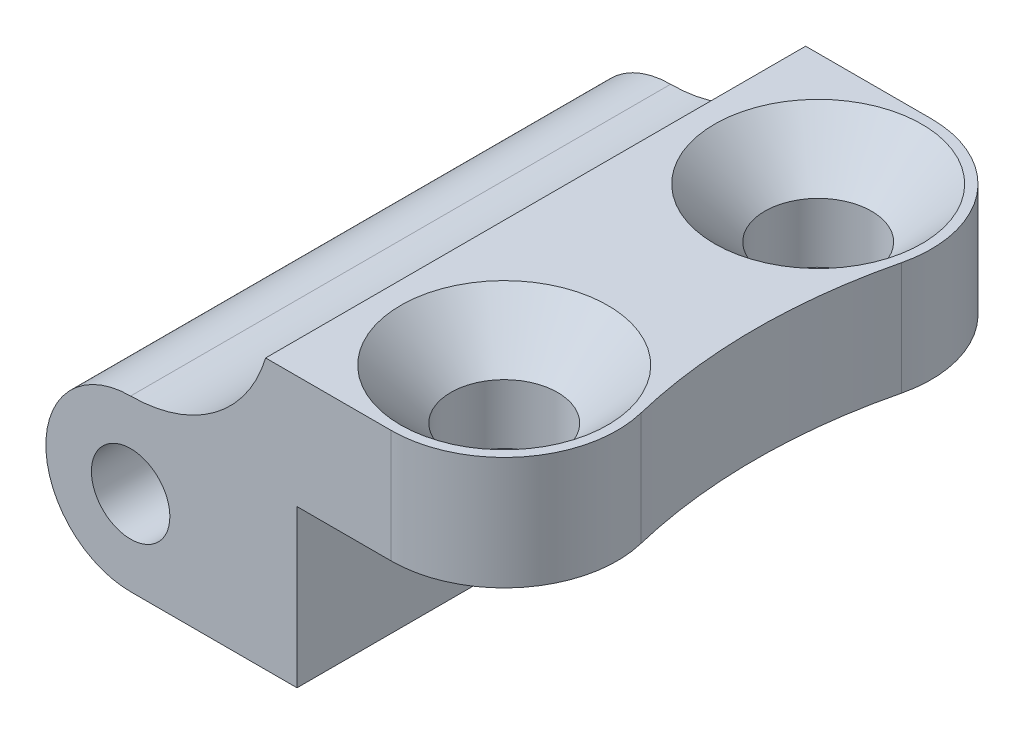
ISO-10303-21;
HEADER;
FILE_DESCRIPTION(('STEP AP214'),'2;1');
FILE_NAME('part.step','',(''),(''),'','','');
FILE_SCHEMA(('AUTOMOTIVE_DESIGN { 1 0 10303 214 1 1 1 1 }'));
ENDSEC;
DATA;
#1=APPLICATION_CONTEXT('core data for automotive mechanical design processes');
#2=APPLICATION_PROTOCOL_DEFINITION('international standard','automotive_design',2000,#1);
#3=PRODUCT_CONTEXT('',#1,'mechanical');
#4=PRODUCT('Part','Part','',(#3));
#5=PRODUCT_RELATED_PRODUCT_CATEGORY('part','',(#4));
#6=PRODUCT_DEFINITION_FORMATION('','',#4);
#7=PRODUCT_DEFINITION_CONTEXT('part definition',#1,'design');
#8=PRODUCT_DEFINITION('design','',#6,#7);
#9=PRODUCT_DEFINITION_SHAPE('','',#8);
#10=(LENGTH_UNIT() NAMED_UNIT(*) SI_UNIT(.MILLI.,.METRE.));
#11=(NAMED_UNIT(*) PLANE_ANGLE_UNIT() SI_UNIT($,.RADIAN.));
#12=(NAMED_UNIT(*) SI_UNIT($,.STERADIAN.) SOLID_ANGLE_UNIT());
#13=UNCERTAINTY_MEASURE_WITH_UNIT(LENGTH_MEASURE(1.E-05),#10,'distance_accuracy_value','');
#14=(GEOMETRIC_REPRESENTATION_CONTEXT(3) GLOBAL_UNCERTAINTY_ASSIGNED_CONTEXT((#13)) GLOBAL_UNIT_ASSIGNED_CONTEXT((#10,
#11,#12)) REPRESENTATION_CONTEXT('',''));
#15=CARTESIAN_POINT('',(0.,0.,0.));
#16=DIRECTION('',(0.,0.,1.));
#17=DIRECTION('',(1.,0.,0.));
#18=AXIS2_PLACEMENT_3D('',#15,#16,#17);
#19=CARTESIAN_POINT('',(0.,0.,0.));
#20=DIRECTION('',(0.,0.,1.));
#21=DIRECTION('',(1.,0.,0.));
#22=AXIS2_PLACEMENT_3D('',#19,#20,#21);
#23=PLANE('',#22);
#24=CARTESIAN_POINT('',(0.,0.,0.));
#25=DIRECTION('',(0.,0.,1.));
#26=DIRECTION('',(1.,0.,0.));
#27=AXIS2_PLACEMENT_3D('',#24,#25,#26);
#28=CIRCLE('',#27,1.25);
#29=CARTESIAN_POINT('',(1.25,0.,0.));
#30=VERTEX_POINT('',#29);
#31=EDGE_CURVE('E199',#30,#30,#28,.T.);
#32=ORIENTED_EDGE('',*,*,#31,.T.);
#33=EDGE_LOOP('',(#32));
#34=FACE_BOUND('',#33,.T.);
#35=DIRECTION('',(0.,1.,0.));
#36=VECTOR('',#35,1.);
#37=CARTESIAN_POINT('',(8.3,-2.7,0.));
#38=LINE('',#37,#36);
#39=CARTESIAN_POINT('',(8.3,2.3,0.));
#40=VERTEX_POINT('',#39);
#41=CARTESIAN_POINT('',(8.29999999999999,5.9,0.));
#42=VERTEX_POINT('',#41);
#43=EDGE_CURVE('E185',#40,#42,#38,.T.);
#44=ORIENTED_EDGE('',*,*,#43,.F.);
#45=DIRECTION('',(1.,0.,0.));
#46=VECTOR('',#45,1.);
#47=CARTESIAN_POINT('',(5.3,2.3,0.));
#48=LINE('',#47,#46);
#49=CARTESIAN_POINT('',(5.3,2.3,0.));
#50=VERTEX_POINT('',#49);
#51=EDGE_CURVE('E227',#50,#40,#48,.T.);
#52=ORIENTED_EDGE('',*,*,#51,.F.);
#53=DIRECTION('',(0.,1.,0.));
#54=VECTOR('',#53,1.);
#55=CARTESIAN_POINT('',(5.3,-2.7,0.));
#56=LINE('',#55,#54);
#57=CARTESIAN_POINT('',(5.3,-2.7,0.));
#58=VERTEX_POINT('',#57);
#59=EDGE_CURVE('E132',#58,#50,#56,.T.);
#60=ORIENTED_EDGE('',*,*,#59,.F.);
#61=DIRECTION('',(1.,0.,0.));
#62=VECTOR('',#61,1.);
#63=CARTESIAN_POINT('',(0.,-2.7,0.));
#64=LINE('',#63,#62);
#65=CARTESIAN_POINT('',(0.,-2.7,0.));
#66=VERTEX_POINT('',#65);
#67=EDGE_CURVE('E224',#66,#58,#64,.T.);
#68=ORIENTED_EDGE('',*,*,#67,.F.);
#69=CARTESIAN_POINT('',(0.,0.,0.));
#70=DIRECTION('',(0.,0.,1.));
#71=DIRECTION('',(1.,0.,0.));
#72=AXIS2_PLACEMENT_3D('',#69,#70,#71);
#73=CIRCLE('',#72,2.7);
#74=CARTESIAN_POINT('',(0.,2.7,0.));
#75=VERTEX_POINT('',#74);
#76=EDGE_CURVE('E203',#75,#66,#73,.T.);
#77=ORIENTED_EDGE('',*,*,#76,.F.);
#78=CARTESIAN_POINT('',(0.,7.1890625,0.));
#79=DIRECTION('',(0.,0.,-1.));
#80=DIRECTION('',(1.,0.,0.));
#81=AXIS2_PLACEMENT_3D('',#78,#79,#80);
#82=CIRCLE('',#81,4.48906249999999);
#83=CARTESIAN_POINT('',(4.3,5.9,0.));
#84=VERTEX_POINT('',#83);
#85=EDGE_CURVE('E210',#84,#75,#82,.T.);
#86=ORIENTED_EDGE('',*,*,#85,.F.);
#87=DIRECTION('',(-1.,0.,0.));
#88=VECTOR('',#87,1.);
#89=CARTESIAN_POINT('',(12.8,5.9,0.));
#90=LINE('',#89,#88);
#91=EDGE_CURVE('E229',#42,#84,#90,.T.);
#92=ORIENTED_EDGE('',*,*,#91,.F.);
#93=EDGE_LOOP('',(#44,#52,#60,#68,#77,#86,#92));
#94=FACE_BOUND('',#93,.T.);
#95=ADVANCED_FACE('F34',(#34,#94),#23,.F.);
#96=CARTESIAN_POINT('',(5.3,2.3,17.2));
#97=DIRECTION('',(0.,1.,0.));
#98=DIRECTION('',(0.,0.,1.));
#99=AXIS2_PLACEMENT_3D('',#96,#97,#98);
#100=PLANE('',#99);
#101=CARTESIAN_POINT('',(8.29999999999999,2.3,3.6));
#102=DIRECTION('',(0.,1.,0.));
#103=DIRECTION('',(0.,0.,1.));
#104=AXIS2_PLACEMENT_3D('',#101,#102,#103);
#105=CIRCLE('',#104,1.53357205176495);
#106=CARTESIAN_POINT('',(8.29999999999999,2.3,5.13357205176495));
#107=VERTEX_POINT('',#106);
#108=EDGE_CURVE('E38',#107,#107,#105,.T.);
#109=ORIENTED_EDGE('',*,*,#108,.T.);
#110=EDGE_LOOP('',(#109));
#111=FACE_BOUND('',#110,.T.);
#112=CARTESIAN_POINT('',(8.3,2.3,13.6));
#113=DIRECTION('',(0.,1.,0.));
#114=DIRECTION('',(0.,0.,1.));
#115=AXIS2_PLACEMENT_3D('',#112,#113,#114);
#116=CIRCLE('',#115,1.53357205176495);
#117=CARTESIAN_POINT('',(8.3,2.3,15.133572051765));
#118=VERTEX_POINT('',#117);
#119=EDGE_CURVE('E173',#118,#118,#116,.T.);
#120=ORIENTED_EDGE('',*,*,#119,.T.);
#121=EDGE_LOOP('',(#120));
#122=FACE_BOUND('',#121,.T.);
#123=DIRECTION('',(0.,0.,-1.));
#124=VECTOR('',#123,1.);
#125=CARTESIAN_POINT('',(5.3,2.3,17.2));
#126=LINE('',#125,#124);
#127=CARTESIAN_POINT('',(5.3,2.3,17.2));
#128=VERTEX_POINT('',#127);
#129=CARTESIAN_POINT('',(5.3,2.3,11.4));
#130=VERTEX_POINT('',#129);
#131=EDGE_CURVE('E135',#128,#130,#126,.T.);
#132=ORIENTED_EDGE('',*,*,#131,.T.);
#133=DIRECTION('',(-1.,0.,0.));
#134=VECTOR('',#133,1.);
#135=CARTESIAN_POINT('',(8.12842712474619,2.3,11.4));
#136=LINE('',#135,#134);
#137=CARTESIAN_POINT('',(8.12842712474619,2.3,11.4));
#138=VERTEX_POINT('',#137);
#139=EDGE_CURVE('E51',#138,#130,#136,.T.);
#140=ORIENTED_EDGE('',*,*,#139,.F.);
#141=DIRECTION('',(0.,0.,-1.));
#142=VECTOR('',#141,1.);
#143=CARTESIAN_POINT('',(8.12842712474619,2.3,11.4));
#144=LINE('',#143,#142);
#145=CARTESIAN_POINT('',(8.12842712474619,2.3,7.4));
#146=VERTEX_POINT('',#145);
#147=EDGE_CURVE('E56',#138,#146,#144,.T.);
#148=ORIENTED_EDGE('',*,*,#147,.T.);
#149=DIRECTION('',(-1.,0.,0.));
#150=VECTOR('',#149,1.);
#151=CARTESIAN_POINT('',(8.12842712474619,2.3,7.4));
#152=LINE('',#151,#150);
#153=CARTESIAN_POINT('',(5.3,2.3,7.4));
#154=VERTEX_POINT('',#153);
#155=EDGE_CURVE('E138',#146,#154,#152,.T.);
#156=ORIENTED_EDGE('',*,*,#155,.T.);
#157=EDGE_CURVE('E125',#154,#50,#126,.T.);
#158=ORIENTED_EDGE('',*,*,#157,.T.);
#159=ORIENTED_EDGE('',*,*,#51,.T.);
#160=CARTESIAN_POINT('',(8.3,2.3,3.6));
#161=DIRECTION('',(0.,1.,0.));
#162=DIRECTION('',(0.,0.,1.));
#163=AXIS2_PLACEMENT_3D('',#160,#161,#162);
#164=CIRCLE('',#163,3.6);
#165=CARTESIAN_POINT('',(11.7977917981073,2.3,4.45173501577287));
#166=VERTEX_POINT('',#165);
#167=EDGE_CURVE('E194',#166,#40,#164,.T.);
#168=ORIENTED_EDGE('',*,*,#167,.F.);
#169=CARTESIAN_POINT('',(28.8333333333334,2.3,8.6));
#170=DIRECTION('',(0.,1.,0.));
#171=DIRECTION('',(0.,0.,1.));
#172=AXIS2_PLACEMENT_3D('',#169,#170,#171);
#173=CIRCLE('',#172,17.5333333333334);
#174=CARTESIAN_POINT('',(11.7977917981073,2.3,12.7482649842271));
#175=VERTEX_POINT('',#174);
#176=EDGE_CURVE('E196',#166,#175,#173,.T.);
#177=ORIENTED_EDGE('',*,*,#176,.T.);
#178=CARTESIAN_POINT('',(8.3,2.3,13.6));
#179=DIRECTION('',(0.,1.,0.));
#180=DIRECTION('',(0.,0.,1.));
#181=AXIS2_PLACEMENT_3D('',#178,#179,#180);
#182=CIRCLE('',#181,3.6);
#183=CARTESIAN_POINT('',(8.3,2.3,17.2));
#184=VERTEX_POINT('',#183);
#185=EDGE_CURVE('E184',#175,#184,#182,.F.);
#186=ORIENTED_EDGE('',*,*,#185,.T.);
#187=DIRECTION('',(1.,0.,0.));
#188=VECTOR('',#187,1.);
#189=CARTESIAN_POINT('',(5.3,2.3,17.2));
#190=LINE('',#189,#188);
#191=EDGE_CURVE('E214',#128,#184,#190,.T.);
#192=ORIENTED_EDGE('',*,*,#191,.F.);
#193=EDGE_LOOP('',(#132,#140,#148,#156,#158,#159,#168,#177,#186,#192));
#194=FACE_BOUND('',#193,.T.);
#195=ADVANCED_FACE('F139',(#111,#122,#194),#100,.F.);
#196=CARTESIAN_POINT('',(12.8,5.9,17.2));
#197=DIRECTION('',(0.,-1.,0.));
#198=DIRECTION('',(1.,0.,0.));
#199=AXIS2_PLACEMENT_3D('',#196,#197,#198);
#200=PLANE('',#199);
#201=CARTESIAN_POINT('',(8.29999999999999,5.9,3.6));
#202=DIRECTION('',(0.,1.,0.));
#203=DIRECTION('',(0.,0.,1.));
#204=AXIS2_PLACEMENT_3D('',#201,#202,#203);
#205=CIRCLE('',#204,3.3);
#206=CARTESIAN_POINT('',(8.29999999999999,5.9,6.9));
#207=VERTEX_POINT('',#206);
#208=EDGE_CURVE('E155',#207,#207,#205,.T.);
#209=ORIENTED_EDGE('',*,*,#208,.F.);
#210=EDGE_LOOP('',(#209));
#211=FACE_BOUND('',#210,.T.);
#212=CARTESIAN_POINT('',(8.3,5.9,13.6));
#213=DIRECTION('',(0.,1.,0.));
#214=DIRECTION('',(0.,0.,1.));
#215=AXIS2_PLACEMENT_3D('',#212,#213,#214);
#216=CIRCLE('',#215,3.3);
#217=CARTESIAN_POINT('',(8.3,5.9,16.9));
#218=VERTEX_POINT('',#217);
#219=EDGE_CURVE('E164',#218,#218,#216,.T.);
#220=ORIENTED_EDGE('',*,*,#219,.F.);
#221=EDGE_LOOP('',(#220));
#222=FACE_BOUND('',#221,.T.);
#223=CARTESIAN_POINT('',(8.29999999999999,5.9,3.6));
#224=DIRECTION('',(0.,1.,0.));
#225=DIRECTION('',(-1.,0.,0.));
#226=AXIS2_PLACEMENT_3D('',#223,#224,#225);
#227=CIRCLE('',#226,3.6);
#228=CARTESIAN_POINT('',(11.7977917981073,5.9,4.45173501577287));
#229=VERTEX_POINT('',#228);
#230=EDGE_CURVE('E178',#229,#42,#227,.T.);
#231=ORIENTED_EDGE('',*,*,#230,.T.);
#232=ORIENTED_EDGE('',*,*,#91,.T.);
#233=DIRECTION('',(0.,0.,-1.));
#234=VECTOR('',#233,1.);
#235=CARTESIAN_POINT('',(4.3,5.9,17.2));
#236=LINE('',#235,#234);
#237=CARTESIAN_POINT('',(4.3,5.9,17.2));
#238=VERTEX_POINT('',#237);
#239=EDGE_CURVE('E136',#238,#84,#236,.T.);
#240=ORIENTED_EDGE('',*,*,#239,.F.);
#241=DIRECTION('',(-1.,0.,0.));
#242=VECTOR('',#241,1.);
#243=CARTESIAN_POINT('',(12.8,5.9,17.2));
#244=LINE('',#243,#242);
#245=CARTESIAN_POINT('',(8.3,5.9,17.2));
#246=VERTEX_POINT('',#245);
#247=EDGE_CURVE('E217',#246,#238,#244,.T.);
#248=ORIENTED_EDGE('',*,*,#247,.F.);
#249=CARTESIAN_POINT('',(8.3,5.9,13.6));
#250=DIRECTION('',(0.,1.,0.));
#251=DIRECTION('',(-1.,0.,0.));
#252=AXIS2_PLACEMENT_3D('',#249,#250,#251);
#253=CIRCLE('',#252,3.6);
#254=CARTESIAN_POINT('',(11.7977917981073,5.9,12.7482649842271));
#255=VERTEX_POINT('',#254);
#256=EDGE_CURVE('E176',#255,#246,#253,.F.);
#257=ORIENTED_EDGE('',*,*,#256,.F.);
#258=CARTESIAN_POINT('',(28.8333333333334,5.9,8.6));
#259=DIRECTION('',(0.,1.,0.));
#260=DIRECTION('',(-1.,0.,0.));
#261=AXIS2_PLACEMENT_3D('',#258,#259,#260);
#262=CIRCLE('',#261,17.5333333333334);
#263=EDGE_CURVE('E174',#229,#255,#262,.T.);
#264=ORIENTED_EDGE('',*,*,#263,.F.);
#265=EDGE_LOOP('',(#231,#232,#240,#248,#257,#264));
#266=FACE_BOUND('',#265,.T.);
#267=ADVANCED_FACE('F263',(#211,#222,#266),#200,.F.);
#268=CARTESIAN_POINT('',(0.,0.,17.2));
#269=DIRECTION('',(0.,0.,1.));
#270=DIRECTION('',(1.,0.,0.));
#271=AXIS2_PLACEMENT_3D('',#268,#269,#270);
#272=PLANE('',#271);
#273=DIRECTION('',(0.,1.,0.));
#274=VECTOR('',#273,1.);
#275=CARTESIAN_POINT('',(8.3,-2.7,17.2));
#276=LINE('',#275,#274);
#277=EDGE_CURVE('E187',#184,#246,#276,.T.);
#278=ORIENTED_EDGE('',*,*,#277,.T.);
#279=ORIENTED_EDGE('',*,*,#247,.T.);
#280=CARTESIAN_POINT('',(0.,7.1890625,17.2));
#281=DIRECTION('',(0.,0.,-1.));
#282=DIRECTION('',(1.,0.,0.));
#283=AXIS2_PLACEMENT_3D('',#280,#281,#282);
#284=CIRCLE('',#283,4.48906249999999);
#285=CARTESIAN_POINT('',(0.,2.7,17.2));
#286=VERTEX_POINT('',#285);
#287=EDGE_CURVE('E219',#238,#286,#284,.T.);
#288=ORIENTED_EDGE('',*,*,#287,.T.);
#289=CARTESIAN_POINT('',(0.,0.,17.2));
#290=DIRECTION('',(0.,0.,1.));
#291=DIRECTION('',(1.,0.,0.));
#292=AXIS2_PLACEMENT_3D('',#289,#290,#291);
#293=CIRCLE('',#292,2.7);
#294=CARTESIAN_POINT('',(0.,-2.7,17.2));
#295=VERTEX_POINT('',#294);
#296=EDGE_CURVE('E206',#286,#295,#293,.T.);
#297=ORIENTED_EDGE('',*,*,#296,.T.);
#298=DIRECTION('',(1.,0.,0.));
#299=VECTOR('',#298,1.);
#300=CARTESIAN_POINT('',(0.,-2.7,17.2));
#301=LINE('',#300,#299);
#302=CARTESIAN_POINT('',(5.3,-2.7,17.2));
#303=VERTEX_POINT('',#302);
#304=EDGE_CURVE('E209',#295,#303,#301,.T.);
#305=ORIENTED_EDGE('',*,*,#304,.T.);
#306=DIRECTION('',(0.,1.,0.));
#307=VECTOR('',#306,1.);
#308=CARTESIAN_POINT('',(5.3,-2.7,17.2));
#309=LINE('',#308,#307);
#310=EDGE_CURVE('E212',#303,#128,#309,.T.);
#311=ORIENTED_EDGE('',*,*,#310,.T.);
#312=ORIENTED_EDGE('',*,*,#191,.T.);
#313=EDGE_LOOP('',(#278,#279,#288,#297,#305,#311,#312));
#314=FACE_BOUND('',#313,.T.);
#315=CARTESIAN_POINT('',(0.,0.,17.2));
#316=DIRECTION('',(0.,0.,1.));
#317=DIRECTION('',(1.,0.,0.));
#318=AXIS2_PLACEMENT_3D('',#315,#316,#317);
#319=CIRCLE('',#318,1.25);
#320=CARTESIAN_POINT('',(1.25,0.,17.2));
#321=VERTEX_POINT('',#320);
#322=EDGE_CURVE('E200',#321,#321,#319,.T.);
#323=ORIENTED_EDGE('',*,*,#322,.F.);
#324=EDGE_LOOP('',(#323));
#325=FACE_BOUND('',#324,.T.);
#326=ADVANCED_FACE('F269',(#314,#325),#272,.T.);
#327=CARTESIAN_POINT('',(0.,0.,17.2));
#328=DIRECTION('',(0.,0.,-1.));
#329=DIRECTION('',(-1.,0.,0.));
#330=AXIS2_PLACEMENT_3D('',#327,#328,#329);
#331=CYLINDRICAL_SURFACE('',#330,2.7);
#332=ORIENTED_EDGE('',*,*,#76,.T.);
#333=DIRECTION('',(0.,0.,-1.));
#334=VECTOR('',#333,1.);
#335=CARTESIAN_POINT('',(0.,-2.7,17.2));
#336=LINE('',#335,#334);
#337=EDGE_CURVE('E11',#295,#66,#336,.T.);
#338=ORIENTED_EDGE('',*,*,#337,.F.);
#339=ORIENTED_EDGE('',*,*,#296,.F.);
#340=DIRECTION('',(0.,0.,-1.));
#341=VECTOR('',#340,1.);
#342=CARTESIAN_POINT('',(0.,2.7,17.2));
#343=LINE('',#342,#341);
#344=EDGE_CURVE('E221',#286,#75,#343,.T.);
#345=ORIENTED_EDGE('',*,*,#344,.T.);
#346=EDGE_LOOP('',(#332,#338,#339,#345));
#347=FACE_BOUND('',#346,.T.);
#348=ADVANCED_FACE('F36',(#347),#331,.T.);
#349=CARTESIAN_POINT('',(0.,-2.7,17.2));
#350=DIRECTION('',(0.,1.,0.));
#351=DIRECTION('',(0.,0.,1.));
#352=AXIS2_PLACEMENT_3D('',#349,#350,#351);
#353=PLANE('',#352);
#354=ORIENTED_EDGE('',*,*,#67,.T.);
#355=DIRECTION('',(0.,0.,-1.));
#356=VECTOR('',#355,1.);
#357=CARTESIAN_POINT('',(5.3,-2.7,17.2));
#358=LINE('',#357,#356);
#359=EDGE_CURVE('E43',#303,#58,#358,.T.);
#360=ORIENTED_EDGE('',*,*,#359,.F.);
#361=ORIENTED_EDGE('',*,*,#304,.F.);
#362=ORIENTED_EDGE('',*,*,#337,.T.);
#363=EDGE_LOOP('',(#354,#360,#361,#362));
#364=FACE_BOUND('',#363,.T.);
#365=ADVANCED_FACE('F280',(#364),#353,.F.);
#366=CARTESIAN_POINT('',(5.3,-2.7,17.2));
#367=DIRECTION('',(-1.,0.,0.));
#368=DIRECTION('',(0.,0.,1.));
#369=AXIS2_PLACEMENT_3D('',#366,#367,#368);
#370=PLANE('',#369);
#371=DIRECTION('',(0.,0.,-1.));
#372=VECTOR('',#371,1.);
#373=CARTESIAN_POINT('',(5.3,-0.528427124746191,11.4));
#374=LINE('',#373,#372);
#375=CARTESIAN_POINT('',(5.3,-0.528427124746191,11.4));
#376=VERTEX_POINT('',#375);
#377=CARTESIAN_POINT('',(5.3,-0.528427124746191,7.4));
#378=VERTEX_POINT('',#377);
#379=EDGE_CURVE('E151',#376,#378,#374,.T.);
#380=ORIENTED_EDGE('',*,*,#379,.F.);
#381=DIRECTION('',(0.,-1.,0.));
#382=VECTOR('',#381,1.);
#383=CARTESIAN_POINT('',(5.3,2.3,11.4));
#384=LINE('',#383,#382);
#385=EDGE_CURVE('E153',#130,#376,#384,.T.);
#386=ORIENTED_EDGE('',*,*,#385,.F.);
#387=ORIENTED_EDGE('',*,*,#131,.F.);
#388=ORIENTED_EDGE('',*,*,#310,.F.);
#389=ORIENTED_EDGE('',*,*,#359,.T.);
#390=ORIENTED_EDGE('',*,*,#59,.T.);
#391=ORIENTED_EDGE('',*,*,#157,.F.);
#392=DIRECTION('',(0.,-1.,0.));
#393=VECTOR('',#392,1.);
#394=CARTESIAN_POINT('',(5.3,2.3,7.4));
#395=LINE('',#394,#393);
#396=EDGE_CURVE('E128',#154,#378,#395,.T.);
#397=ORIENTED_EDGE('',*,*,#396,.T.);
#398=EDGE_LOOP('',(#380,#386,#387,#388,#389,#390,#391,#397));
#399=FACE_BOUND('',#398,.T.);
#400=ADVANCED_FACE('F126',(#399),#370,.F.);
#401=CARTESIAN_POINT('',(0.,7.1890625,17.2));
#402=DIRECTION('',(0.,0.,-1.));
#403=DIRECTION('',(-1.,0.,0.));
#404=AXIS2_PLACEMENT_3D('',#401,#402,#403);
#405=CYLINDRICAL_SURFACE('',#404,4.48906249999999);
#406=ORIENTED_EDGE('',*,*,#85,.T.);
#407=ORIENTED_EDGE('',*,*,#344,.F.);
#408=ORIENTED_EDGE('',*,*,#287,.F.);
#409=ORIENTED_EDGE('',*,*,#239,.T.);
#410=EDGE_LOOP('',(#406,#407,#408,#409));
#411=FACE_BOUND('',#410,.T.);
#412=ADVANCED_FACE('F271',(#411),#405,.F.);
#413=CARTESIAN_POINT('',(0.,0.,17.2));
#414=DIRECTION('',(0.,0.,-1.));
#415=DIRECTION('',(-1.,0.,0.));
#416=AXIS2_PLACEMENT_3D('',#413,#414,#415);
#417=CYLINDRICAL_SURFACE('',#416,1.25);
#418=ORIENTED_EDGE('',*,*,#322,.T.);
#419=EDGE_LOOP('',(#418));
#420=FACE_BOUND('',#419,.T.);
#421=ORIENTED_EDGE('',*,*,#31,.F.);
#422=EDGE_LOOP('',(#421));
#423=FACE_BOUND('',#422,.T.);
#424=ADVANCED_FACE('F274',(#420,#423),#417,.F.);
#425=CARTESIAN_POINT('',(28.8333333333334,-2.7,8.6));
#426=DIRECTION('',(0.,1.,0.));
#427=DIRECTION('',(-1.,0.,0.));
#428=AXIS2_PLACEMENT_3D('',#425,#426,#427);
#429=CYLINDRICAL_SURFACE('',#428,17.5333333333334);
#430=DIRECTION('',(0.,1.,0.));
#431=VECTOR('',#430,1.);
#432=CARTESIAN_POINT('',(11.7977917981073,-2.7,4.45173501577287));
#433=LINE('',#432,#431);
#434=EDGE_CURVE('E182',#166,#229,#433,.T.);
#435=ORIENTED_EDGE('',*,*,#434,.T.);
#436=ORIENTED_EDGE('',*,*,#263,.T.);
#437=DIRECTION('',(0.,1.,0.));
#438=VECTOR('',#437,1.);
#439=CARTESIAN_POINT('',(11.7977917981073,-2.7,12.7482649842271));
#440=LINE('',#439,#438);
#441=EDGE_CURVE('E181',#175,#255,#440,.T.);
#442=ORIENTED_EDGE('',*,*,#441,.F.);
#443=ORIENTED_EDGE('',*,*,#176,.F.);
#444=EDGE_LOOP('',(#435,#436,#442,#443));
#445=FACE_BOUND('',#444,.T.);
#446=ADVANCED_FACE('F300',(#445),#429,.F.);
#447=CARTESIAN_POINT('',(8.3,-2.7,3.6));
#448=DIRECTION('',(0.,1.,0.));
#449=DIRECTION('',(-1.,0.,0.));
#450=AXIS2_PLACEMENT_3D('',#447,#448,#449);
#451=CYLINDRICAL_SURFACE('',#450,3.6);
#452=ORIENTED_EDGE('',*,*,#167,.T.);
#453=ORIENTED_EDGE('',*,*,#43,.T.);
#454=ORIENTED_EDGE('',*,*,#230,.F.);
#455=ORIENTED_EDGE('',*,*,#434,.F.);
#456=EDGE_LOOP('',(#452,#453,#454,#455));
#457=FACE_BOUND('',#456,.T.);
#458=ADVANCED_FACE('F253',(#457),#451,.T.);
#459=CARTESIAN_POINT('',(8.3,-2.7,13.6));
#460=DIRECTION('',(0.,1.,0.));
#461=DIRECTION('',(-1.,0.,0.));
#462=AXIS2_PLACEMENT_3D('',#459,#460,#461);
#463=CYLINDRICAL_SURFACE('',#462,3.6);
#464=ORIENTED_EDGE('',*,*,#441,.T.);
#465=ORIENTED_EDGE('',*,*,#256,.T.);
#466=ORIENTED_EDGE('',*,*,#277,.F.);
#467=ORIENTED_EDGE('',*,*,#185,.F.);
#468=EDGE_LOOP('',(#464,#465,#466,#467));
#469=FACE_BOUND('',#468,.T.);
#470=ADVANCED_FACE('F243',(#469),#463,.T.);
#471=CARTESIAN_POINT('',(8.3,2.4,13.6));
#472=DIRECTION('',(0.,1.,0.));
#473=DIRECTION('',(0.,0.,1.));
#474=AXIS2_PLACEMENT_3D('',#471,#472,#473);
#475=CONICAL_SURFACE('',#474,1.7,1.02974425867665);
#476=CARTESIAN_POINT('',(8.3,2.4,13.6));
#477=DIRECTION('',(0.,1.,0.));
#478=DIRECTION('',(0.,0.,1.));
#479=AXIS2_PLACEMENT_3D('',#476,#477,#478);
#480=CIRCLE('',#479,1.7);
#481=CARTESIAN_POINT('',(8.3,2.4,15.3));
#482=VERTEX_POINT('',#481);
#483=EDGE_CURVE('E170',#482,#482,#480,.T.);
#484=ORIENTED_EDGE('',*,*,#483,.T.);
#485=EDGE_LOOP('',(#484));
#486=FACE_BOUND('',#485,.T.);
#487=ORIENTED_EDGE('',*,*,#119,.F.);
#488=EDGE_LOOP('',(#487));
#489=FACE_BOUND('',#488,.T.);
#490=ADVANCED_FACE('F240',(#486,#489),#475,.F.);
#491=CARTESIAN_POINT('',(8.3,5.9,13.6));
#492=DIRECTION('',(0.,1.,0.));
#493=DIRECTION('',(0.,0.,1.));
#494=AXIS2_PLACEMENT_3D('',#491,#492,#493);
#495=CYLINDRICAL_SURFACE('',#494,1.7);
#496=ORIENTED_EDGE('',*,*,#483,.F.);
#497=EDGE_LOOP('',(#496));
#498=FACE_BOUND('',#497,.T.);
#499=CARTESIAN_POINT('',(8.3,4.3,13.6));
#500=DIRECTION('',(0.,1.,0.));
#501=DIRECTION('',(0.,0.,1.));
#502=AXIS2_PLACEMENT_3D('',#499,#500,#501);
#503=CIRCLE('',#502,1.7);
#504=CARTESIAN_POINT('',(8.3,4.3,15.3));
#505=VERTEX_POINT('',#504);
#506=EDGE_CURVE('E167',#505,#505,#503,.T.);
#507=ORIENTED_EDGE('',*,*,#506,.T.);
#508=EDGE_LOOP('',(#507));
#509=FACE_BOUND('',#508,.T.);
#510=ADVANCED_FACE('F242',(#498,#509),#495,.F.);
#511=CARTESIAN_POINT('',(8.3,5.9,13.6));
#512=DIRECTION('',(0.,1.,0.));
#513=DIRECTION('',(0.,0.,1.));
#514=AXIS2_PLACEMENT_3D('',#511,#512,#513);
#515=CONICAL_SURFACE('',#514,3.3,0.785398163397449);
#516=ORIENTED_EDGE('',*,*,#506,.F.);
#517=EDGE_LOOP('',(#516));
#518=FACE_BOUND('',#517,.T.);
#519=ORIENTED_EDGE('',*,*,#219,.T.);
#520=EDGE_LOOP('',(#519));
#521=FACE_BOUND('',#520,.T.);
#522=ADVANCED_FACE('F250',(#518,#521),#515,.F.);
#523=CARTESIAN_POINT('',(8.29999999999999,2.4,3.6));
#524=DIRECTION('',(0.,1.,0.));
#525=DIRECTION('',(0.,0.,1.));
#526=AXIS2_PLACEMENT_3D('',#523,#524,#525);
#527=CONICAL_SURFACE('',#526,1.7,1.02974425867665);
#528=CARTESIAN_POINT('',(8.29999999999999,2.4,3.6));
#529=DIRECTION('',(0.,1.,0.));
#530=DIRECTION('',(0.,0.,1.));
#531=AXIS2_PLACEMENT_3D('',#528,#529,#530);
#532=CIRCLE('',#531,1.7);
#533=CARTESIAN_POINT('',(8.29999999999999,2.4,5.3));
#534=VERTEX_POINT('',#533);
#535=EDGE_CURVE('E161',#534,#534,#532,.T.);
#536=ORIENTED_EDGE('',*,*,#535,.T.);
#537=EDGE_LOOP('',(#536));
#538=FACE_BOUND('',#537,.T.);
#539=ORIENTED_EDGE('',*,*,#108,.F.);
#540=EDGE_LOOP('',(#539));
#541=FACE_BOUND('',#540,.T.);
#542=ADVANCED_FACE('F334',(#538,#541),#527,.F.);
#543=CARTESIAN_POINT('',(8.29999999999999,5.9,3.6));
#544=DIRECTION('',(0.,1.,0.));
#545=DIRECTION('',(0.,0.,1.));
#546=AXIS2_PLACEMENT_3D('',#543,#544,#545);
#547=CYLINDRICAL_SURFACE('',#546,1.7);
#548=ORIENTED_EDGE('',*,*,#535,.F.);
#549=EDGE_LOOP('',(#548));
#550=FACE_BOUND('',#549,.T.);
#551=CARTESIAN_POINT('',(8.29999999999999,4.3,3.6));
#552=DIRECTION('',(0.,1.,0.));
#553=DIRECTION('',(0.,0.,1.));
#554=AXIS2_PLACEMENT_3D('',#551,#552,#553);
#555=CIRCLE('',#554,1.7);
#556=CARTESIAN_POINT('',(8.29999999999999,4.3,5.3));
#557=VERTEX_POINT('',#556);
#558=EDGE_CURVE('E158',#557,#557,#555,.T.);
#559=ORIENTED_EDGE('',*,*,#558,.T.);
#560=EDGE_LOOP('',(#559));
#561=FACE_BOUND('',#560,.T.);
#562=ADVANCED_FACE('F327',(#550,#561),#547,.F.);
#563=CARTESIAN_POINT('',(8.29999999999999,5.9,3.6));
#564=DIRECTION('',(0.,1.,0.));
#565=DIRECTION('',(0.,0.,1.));
#566=AXIS2_PLACEMENT_3D('',#563,#564,#565);
#567=CONICAL_SURFACE('',#566,3.3,0.785398163397449);
#568=ORIENTED_EDGE('',*,*,#558,.F.);
#569=EDGE_LOOP('',(#568));
#570=FACE_BOUND('',#569,.T.);
#571=ORIENTED_EDGE('',*,*,#208,.T.);
#572=EDGE_LOOP('',(#571));
#573=FACE_BOUND('',#572,.T.);
#574=ADVANCED_FACE('F320',(#570,#573),#567,.F.);
#575=CARTESIAN_POINT('',(5.3,-0.528427124746191,11.4));
#576=DIRECTION('',(-0.707106781186547,0.707106781186548,0.));
#577=DIRECTION('',(-0.707106781186548,-0.707106781186547,0.));
#578=AXIS2_PLACEMENT_3D('',#575,#576,#577);
#579=PLANE('',#578);
#580=DIRECTION('',(0.707106781186548,0.707106781186547,0.));
#581=VECTOR('',#580,1.);
#582=CARTESIAN_POINT('',(5.3,-0.528427124746191,7.4));
#583=LINE('',#582,#581);
#584=EDGE_CURVE('E143',#378,#146,#583,.T.);
#585=ORIENTED_EDGE('',*,*,#584,.T.);
#586=ORIENTED_EDGE('',*,*,#147,.F.);
#587=DIRECTION('',(0.707106781186548,0.707106781186547,0.));
#588=VECTOR('',#587,1.);
#589=CARTESIAN_POINT('',(5.3,-0.528427124746191,11.4));
#590=LINE('',#589,#588);
#591=EDGE_CURVE('E146',#376,#138,#590,.T.);
#592=ORIENTED_EDGE('',*,*,#591,.F.);
#593=ORIENTED_EDGE('',*,*,#379,.T.);
#594=EDGE_LOOP('',(#585,#586,#592,#593));
#595=FACE_BOUND('',#594,.T.);
#596=ADVANCED_FACE('F318',(#595),#579,.F.);
#597=CARTESIAN_POINT('',(0.,0.,11.4));
#598=DIRECTION('',(0.,0.,1.));
#599=DIRECTION('',(1.,0.,0.));
#600=AXIS2_PLACEMENT_3D('',#597,#598,#599);
#601=PLANE('',#600);
#602=ORIENTED_EDGE('',*,*,#591,.T.);
#603=ORIENTED_EDGE('',*,*,#139,.T.);
#604=ORIENTED_EDGE('',*,*,#385,.T.);
#605=EDGE_LOOP('',(#602,#603,#604));
#606=FACE_BOUND('',#605,.T.);
#607=ADVANCED_FACE('F313',(#606),#601,.T.);
#608=CARTESIAN_POINT('',(0.,0.,7.4));
#609=DIRECTION('',(0.,0.,1.));
#610=DIRECTION('',(1.,0.,0.));
#611=AXIS2_PLACEMENT_3D('',#608,#609,#610);
#612=PLANE('',#611);
#613=ORIENTED_EDGE('',*,*,#584,.F.);
#614=ORIENTED_EDGE('',*,*,#396,.F.);
#615=ORIENTED_EDGE('',*,*,#155,.F.);
#616=EDGE_LOOP('',(#613,#614,#615));
#617=FACE_BOUND('',#616,.T.);
#618=ADVANCED_FACE('F145',(#617),#612,.F.);
#619=CLOSED_SHELL('',(#95,#195,#267,#326,#348,#365,#400,#412,#424,#446,#458,#470,#490,#510,#522,
#542,#562,#574,#596,#607,#618));
#620=MANIFOLD_SOLID_BREP('B2',#619);
#621=ADVANCED_BREP_SHAPE_REPRESENTATION('',(#18,#620),#14);
#622=SHAPE_DEFINITION_REPRESENTATION(#9,#621);
ENDSEC;
END-ISO-10303-21;
